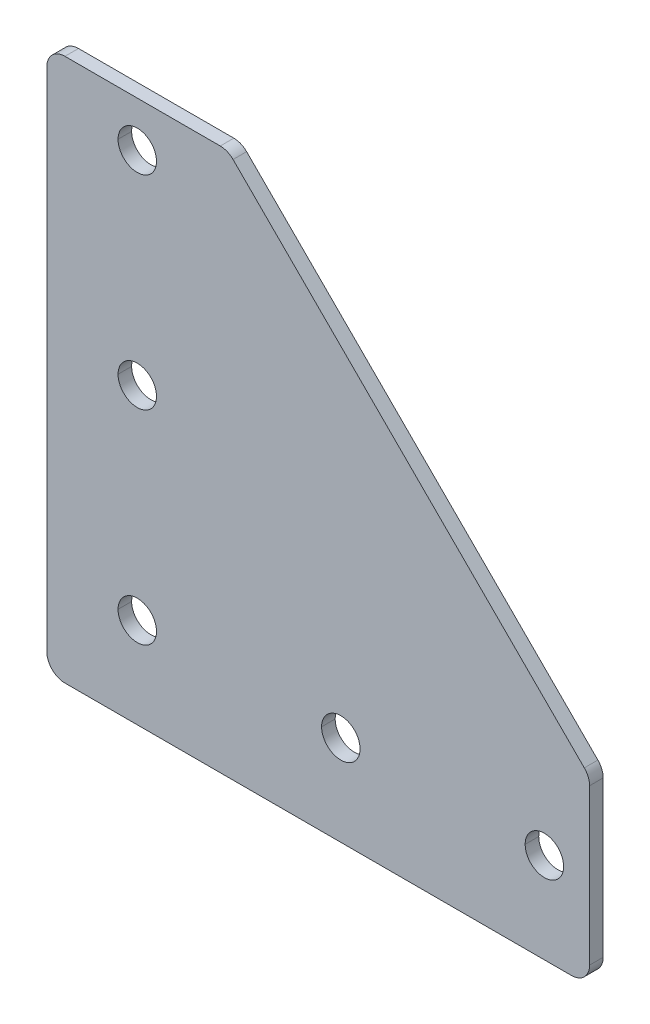
ISO-10303-21;
HEADER;
FILE_DESCRIPTION(('STEP AP214'),'2;1');
FILE_NAME('part.step','',(''),(''),'','','');
FILE_SCHEMA(('AUTOMOTIVE_DESIGN { 1 0 10303 214 1 1 1 1 }'));
ENDSEC;
DATA;
#1=APPLICATION_CONTEXT('core data for automotive mechanical design processes');
#2=APPLICATION_PROTOCOL_DEFINITION('international standard','automotive_design',2000,#1);
#3=PRODUCT_CONTEXT('',#1,'mechanical');
#4=PRODUCT('Part','Part','',(#3));
#5=PRODUCT_RELATED_PRODUCT_CATEGORY('part','',(#4));
#6=PRODUCT_DEFINITION_FORMATION('','',#4);
#7=PRODUCT_DEFINITION_CONTEXT('part definition',#1,'design');
#8=PRODUCT_DEFINITION('design','',#6,#7);
#9=PRODUCT_DEFINITION_SHAPE('','',#8);
#10=(LENGTH_UNIT() NAMED_UNIT(*) SI_UNIT(.MILLI.,.METRE.));
#11=(NAMED_UNIT(*) PLANE_ANGLE_UNIT() SI_UNIT($,.RADIAN.));
#12=(NAMED_UNIT(*) SI_UNIT($,.STERADIAN.) SOLID_ANGLE_UNIT());
#13=UNCERTAINTY_MEASURE_WITH_UNIT(LENGTH_MEASURE(1.E-05),#10,'distance_accuracy_value','');
#14=(GEOMETRIC_REPRESENTATION_CONTEXT(3) GLOBAL_UNCERTAINTY_ASSIGNED_CONTEXT((#13)) GLOBAL_UNIT_ASSIGNED_CONTEXT((#10,
#11,#12)) REPRESENTATION_CONTEXT('',''));
#15=CARTESIAN_POINT('',(0.,0.,0.));
#16=DIRECTION('',(0.,0.,1.));
#17=DIRECTION('',(1.,0.,0.));
#18=AXIS2_PLACEMENT_3D('',#15,#16,#17);
#19=CARTESIAN_POINT('',(0.,0.,0.));
#20=DIRECTION('',(0.,0.,1.));
#21=DIRECTION('',(1.,0.,0.));
#22=AXIS2_PLACEMENT_3D('',#19,#20,#21);
#23=PLANE('',#22);
#24=CARTESIAN_POINT('',(65.,20.,0.));
#25=DIRECTION('',(0.,0.,1.));
#26=DIRECTION('',(1.,0.,0.));
#27=AXIS2_PLACEMENT_3D('',#24,#25,#26);
#28=CIRCLE('',#27,4.25);
#29=CARTESIAN_POINT('',(60.75,20.,0.));
#30=VERTEX_POINT('',#29);
#31=CARTESIAN_POINT('',(69.25,20.,0.));
#32=VERTEX_POINT('',#31);
#33=EDGE_CURVE('E307',#30,#32,#28,.T.);
#34=ORIENTED_EDGE('',*,*,#33,.T.);
#35=CARTESIAN_POINT('',(65.,20.,0.));
#36=DIRECTION('',(0.,0.,1.));
#37=DIRECTION('',(1.,0.,0.));
#38=AXIS2_PLACEMENT_3D('',#35,#36,#37);
#39=CIRCLE('',#38,4.25);
#40=EDGE_CURVE('E319',#32,#30,#39,.T.);
#41=ORIENTED_EDGE('',*,*,#40,.T.);
#42=EDGE_LOOP('',(#34,#41));
#43=FACE_BOUND('',#42,.T.);
#44=CARTESIAN_POINT('',(110.,20.,0.));
#45=DIRECTION('',(0.,0.,1.));
#46=DIRECTION('',(1.,0.,0.));
#47=AXIS2_PLACEMENT_3D('',#44,#45,#46);
#48=CIRCLE('',#47,4.25);
#49=CARTESIAN_POINT('',(105.75,20.,0.));
#50=VERTEX_POINT('',#49);
#51=CARTESIAN_POINT('',(114.25,20.,0.));
#52=VERTEX_POINT('',#51);
#53=EDGE_CURVE('E253',#50,#52,#48,.T.);
#54=ORIENTED_EDGE('',*,*,#53,.T.);
#55=CARTESIAN_POINT('',(110.,20.,0.));
#56=DIRECTION('',(0.,0.,1.));
#57=DIRECTION('',(1.,0.,0.));
#58=AXIS2_PLACEMENT_3D('',#55,#56,#57);
#59=CIRCLE('',#58,4.25);
#60=EDGE_CURVE('E413',#52,#50,#59,.T.);
#61=ORIENTED_EDGE('',*,*,#60,.T.);
#62=EDGE_LOOP('',(#54,#61));
#63=FACE_BOUND('',#62,.T.);
#64=CARTESIAN_POINT('',(20.,20.,0.));
#65=DIRECTION('',(0.,0.,1.));
#66=DIRECTION('',(1.,0.,0.));
#67=AXIS2_PLACEMENT_3D('',#64,#65,#66);
#68=CIRCLE('',#67,4.25);
#69=CARTESIAN_POINT('',(15.75,20.,0.));
#70=VERTEX_POINT('',#69);
#71=CARTESIAN_POINT('',(24.25,20.,0.));
#72=VERTEX_POINT('',#71);
#73=EDGE_CURVE('E256',#70,#72,#68,.T.);
#74=ORIENTED_EDGE('',*,*,#73,.T.);
#75=CARTESIAN_POINT('',(20.,20.,0.));
#76=DIRECTION('',(0.,0.,1.));
#77=DIRECTION('',(1.,0.,0.));
#78=AXIS2_PLACEMENT_3D('',#75,#76,#77);
#79=CIRCLE('',#78,4.25);
#80=EDGE_CURVE('E212',#72,#70,#79,.T.);
#81=ORIENTED_EDGE('',*,*,#80,.T.);
#82=EDGE_LOOP('',(#74,#81));
#83=FACE_BOUND('',#82,.T.);
#84=CARTESIAN_POINT('',(20.,65.,0.));
#85=DIRECTION('',(0.,0.,1.));
#86=DIRECTION('',(1.,0.,0.));
#87=AXIS2_PLACEMENT_3D('',#84,#85,#86);
#88=CIRCLE('',#87,4.25);
#89=CARTESIAN_POINT('',(15.75,65.,0.));
#90=VERTEX_POINT('',#89);
#91=CARTESIAN_POINT('',(24.25,65.,0.));
#92=VERTEX_POINT('',#91);
#93=EDGE_CURVE('E218',#90,#92,#88,.T.);
#94=ORIENTED_EDGE('',*,*,#93,.T.);
#95=CARTESIAN_POINT('',(20.,65.,0.));
#96=DIRECTION('',(0.,0.,1.));
#97=DIRECTION('',(1.,0.,0.));
#98=AXIS2_PLACEMENT_3D('',#95,#96,#97);
#99=CIRCLE('',#98,4.25);
#100=EDGE_CURVE('E211',#92,#90,#99,.T.);
#101=ORIENTED_EDGE('',*,*,#100,.T.);
#102=EDGE_LOOP('',(#94,#101));
#103=FACE_BOUND('',#102,.T.);
#104=CARTESIAN_POINT('',(20.,110.,0.));
#105=DIRECTION('',(0.,0.,1.));
#106=DIRECTION('',(1.,0.,0.));
#107=AXIS2_PLACEMENT_3D('',#104,#105,#106);
#108=CIRCLE('',#107,4.25);
#109=CARTESIAN_POINT('',(15.75,110.,0.));
#110=VERTEX_POINT('',#109);
#111=CARTESIAN_POINT('',(24.25,110.,0.));
#112=VERTEX_POINT('',#111);
#113=EDGE_CURVE('E234',#110,#112,#108,.T.);
#114=ORIENTED_EDGE('',*,*,#113,.T.);
#115=CARTESIAN_POINT('',(20.,110.,0.));
#116=DIRECTION('',(0.,0.,1.));
#117=DIRECTION('',(1.,0.,0.));
#118=AXIS2_PLACEMENT_3D('',#115,#116,#117);
#119=CIRCLE('',#118,4.25);
#120=EDGE_CURVE('E422',#112,#110,#119,.T.);
#121=ORIENTED_EDGE('',*,*,#120,.T.);
#122=EDGE_LOOP('',(#114,#121));
#123=FACE_BOUND('',#122,.T.);
#124=DIRECTION('',(0.707106781186644,-0.707106781186451,0.));
#125=VECTOR('',#124,1.);
#126=CARTESIAN_POINT('',(79.9999999999836,80.0000000000055,0.));
#127=LINE('',#126,#125);
#128=CARTESIAN_POINT('',(41.1715728752392,118.828427124739,0.));
#129=VERTEX_POINT('',#128);
#130=CARTESIAN_POINT('',(118.828427124746,41.1715728752539,0.));
#131=VERTEX_POINT('',#130);
#132=EDGE_CURVE('E315',#129,#131,#127,.T.);
#133=ORIENTED_EDGE('',*,*,#132,.T.);
#134=CARTESIAN_POINT('',(116.,38.3431457505073,0.));
#135=DIRECTION('',(0.,0.,1.));
#136=DIRECTION('',(1.,0.,0.));
#137=AXIS2_PLACEMENT_3D('',#134,#135,#136);
#138=CIRCLE('',#137,4.);
#139=CARTESIAN_POINT('',(120.,38.3431457505073,0.));
#140=VERTEX_POINT('',#139);
#141=EDGE_CURVE('E19',#140,#131,#138,.T.);
#142=ORIENTED_EDGE('',*,*,#141,.F.);
#143=DIRECTION('',(0.,1.,0.));
#144=VECTOR('',#143,1.);
#145=CARTESIAN_POINT('',(120.,0.,0.));
#146=LINE('',#145,#144);
#147=CARTESIAN_POINT('',(120.,4.,0.));
#148=VERTEX_POINT('',#147);
#149=EDGE_CURVE('E399',#148,#140,#146,.T.);
#150=ORIENTED_EDGE('',*,*,#149,.F.);
#151=CARTESIAN_POINT('',(116.,4.,0.));
#152=DIRECTION('',(0.,0.,1.));
#153=DIRECTION('',(1.,0.,0.));
#154=AXIS2_PLACEMENT_3D('',#151,#152,#153);
#155=CIRCLE('',#154,4.);
#156=CARTESIAN_POINT('',(116.,0.,0.));
#157=VERTEX_POINT('',#156);
#158=EDGE_CURVE('E387',#157,#148,#155,.T.);
#159=ORIENTED_EDGE('',*,*,#158,.F.);
#160=DIRECTION('',(1.,0.,0.));
#161=VECTOR('',#160,1.);
#162=CARTESIAN_POINT('',(0.,0.,0.));
#163=LINE('',#162,#161);
#164=CARTESIAN_POINT('',(4.,0.,0.));
#165=VERTEX_POINT('',#164);
#166=EDGE_CURVE('E303',#165,#157,#163,.T.);
#167=ORIENTED_EDGE('',*,*,#166,.F.);
#168=CARTESIAN_POINT('',(4.,4.,0.));
#169=DIRECTION('',(0.,0.,1.));
#170=DIRECTION('',(1.,0.,0.));
#171=AXIS2_PLACEMENT_3D('',#168,#169,#170);
#172=CIRCLE('',#171,4.);
#173=CARTESIAN_POINT('',(0.,4.,0.));
#174=VERTEX_POINT('',#173);
#175=EDGE_CURVE('E373',#174,#165,#172,.T.);
#176=ORIENTED_EDGE('',*,*,#175,.F.);
#177=DIRECTION('',(0.,1.,0.));
#178=VECTOR('',#177,1.);
#179=CARTESIAN_POINT('',(0.,0.,0.));
#180=LINE('',#179,#178);
#181=CARTESIAN_POINT('',(0.,115.999999999993,0.));
#182=VERTEX_POINT('',#181);
#183=EDGE_CURVE('E356',#174,#182,#180,.T.);
#184=ORIENTED_EDGE('',*,*,#183,.T.);
#185=CARTESIAN_POINT('',(4.,115.999999999993,0.));
#186=DIRECTION('',(0.,0.,1.));
#187=DIRECTION('',(1.,0.,0.));
#188=AXIS2_PLACEMENT_3D('',#185,#186,#187);
#189=CIRCLE('',#188,4.);
#190=CARTESIAN_POINT('',(4.,119.999999999993,0.));
#191=VERTEX_POINT('',#190);
#192=EDGE_CURVE('E342',#191,#182,#189,.T.);
#193=ORIENTED_EDGE('',*,*,#192,.F.);
#194=DIRECTION('',(1.,0.,0.));
#195=VECTOR('',#194,1.);
#196=CARTESIAN_POINT('',(0.,119.999999999993,0.));
#197=LINE('',#196,#195);
#198=CARTESIAN_POINT('',(38.3431457504934,119.999999999993,0.));
#199=VERTEX_POINT('',#198);
#200=EDGE_CURVE('E271',#191,#199,#197,.T.);
#201=ORIENTED_EDGE('',*,*,#200,.T.);
#202=CARTESIAN_POINT('',(38.3431457504934,115.999999999993,0.));
#203=DIRECTION('',(0.,0.,1.));
#204=DIRECTION('',(1.,0.,0.));
#205=AXIS2_PLACEMENT_3D('',#202,#203,#204);
#206=CIRCLE('',#205,4.);
#207=EDGE_CURVE('E281',#129,#199,#206,.T.);
#208=ORIENTED_EDGE('',*,*,#207,.F.);
#209=EDGE_LOOP('',(#133,#142,#150,#159,#167,#176,#184,#193,#201,#208));
#210=FACE_BOUND('',#209,.T.);
#211=ADVANCED_FACE('F16',(#43,#63,#83,#103,#123,#210),#23,.F.);
#212=CARTESIAN_POINT('',(0.,0.,3.));
#213=DIRECTION('',(0.,0.,1.));
#214=DIRECTION('',(1.,0.,0.));
#215=AXIS2_PLACEMENT_3D('',#212,#213,#214);
#216=PLANE('',#215);
#217=CARTESIAN_POINT('',(65.,20.,3.));
#218=DIRECTION('',(0.,0.,1.));
#219=DIRECTION('',(1.,0.,0.));
#220=AXIS2_PLACEMENT_3D('',#217,#218,#219);
#221=CIRCLE('',#220,4.25);
#222=CARTESIAN_POINT('',(60.75,20.,3.));
#223=VERTEX_POINT('',#222);
#224=CARTESIAN_POINT('',(69.25,20.,3.));
#225=VERTEX_POINT('',#224);
#226=EDGE_CURVE('E277',#223,#225,#221,.T.);
#227=ORIENTED_EDGE('',*,*,#226,.F.);
#228=CARTESIAN_POINT('',(65.,20.,3.));
#229=DIRECTION('',(0.,0.,1.));
#230=DIRECTION('',(1.,0.,0.));
#231=AXIS2_PLACEMENT_3D('',#228,#229,#230);
#232=CIRCLE('',#231,4.25);
#233=EDGE_CURVE('E316',#225,#223,#232,.T.);
#234=ORIENTED_EDGE('',*,*,#233,.F.);
#235=EDGE_LOOP('',(#227,#234));
#236=FACE_BOUND('',#235,.T.);
#237=CARTESIAN_POINT('',(110.,20.,3.));
#238=DIRECTION('',(0.,0.,1.));
#239=DIRECTION('',(1.,0.,0.));
#240=AXIS2_PLACEMENT_3D('',#237,#238,#239);
#241=CIRCLE('',#240,4.25);
#242=CARTESIAN_POINT('',(105.75,20.,3.));
#243=VERTEX_POINT('',#242);
#244=CARTESIAN_POINT('',(114.25,20.,3.));
#245=VERTEX_POINT('',#244);
#246=EDGE_CURVE('E254',#243,#245,#241,.T.);
#247=ORIENTED_EDGE('',*,*,#246,.F.);
#248=CARTESIAN_POINT('',(110.,20.,3.));
#249=DIRECTION('',(0.,0.,1.));
#250=DIRECTION('',(1.,0.,0.));
#251=AXIS2_PLACEMENT_3D('',#248,#249,#250);
#252=CIRCLE('',#251,4.25);
#253=EDGE_CURVE('E410',#245,#243,#252,.T.);
#254=ORIENTED_EDGE('',*,*,#253,.F.);
#255=EDGE_LOOP('',(#247,#254));
#256=FACE_BOUND('',#255,.T.);
#257=CARTESIAN_POINT('',(20.,20.,3.));
#258=DIRECTION('',(0.,0.,1.));
#259=DIRECTION('',(1.,0.,0.));
#260=AXIS2_PLACEMENT_3D('',#257,#258,#259);
#261=CIRCLE('',#260,4.25);
#262=CARTESIAN_POINT('',(15.75,20.,3.));
#263=VERTEX_POINT('',#262);
#264=CARTESIAN_POINT('',(24.25,20.,3.));
#265=VERTEX_POINT('',#264);
#266=EDGE_CURVE('E220',#263,#265,#261,.T.);
#267=ORIENTED_EDGE('',*,*,#266,.F.);
#268=CARTESIAN_POINT('',(20.,20.,3.));
#269=DIRECTION('',(0.,0.,1.));
#270=DIRECTION('',(1.,0.,0.));
#271=AXIS2_PLACEMENT_3D('',#268,#269,#270);
#272=CIRCLE('',#271,4.25);
#273=EDGE_CURVE('E237',#265,#263,#272,.T.);
#274=ORIENTED_EDGE('',*,*,#273,.F.);
#275=EDGE_LOOP('',(#267,#274));
#276=FACE_BOUND('',#275,.T.);
#277=CARTESIAN_POINT('',(20.,65.,3.));
#278=DIRECTION('',(0.,0.,1.));
#279=DIRECTION('',(1.,0.,0.));
#280=AXIS2_PLACEMENT_3D('',#277,#278,#279);
#281=CIRCLE('',#280,4.25);
#282=CARTESIAN_POINT('',(15.75,65.,3.));
#283=VERTEX_POINT('',#282);
#284=CARTESIAN_POINT('',(24.25,65.,3.));
#285=VERTEX_POINT('',#284);
#286=EDGE_CURVE('E216',#283,#285,#281,.T.);
#287=ORIENTED_EDGE('',*,*,#286,.F.);
#288=CARTESIAN_POINT('',(20.,65.,3.));
#289=DIRECTION('',(0.,0.,1.));
#290=DIRECTION('',(1.,0.,0.));
#291=AXIS2_PLACEMENT_3D('',#288,#289,#290);
#292=CIRCLE('',#291,4.25);
#293=EDGE_CURVE('E200',#285,#283,#292,.T.);
#294=ORIENTED_EDGE('',*,*,#293,.F.);
#295=EDGE_LOOP('',(#287,#294));
#296=FACE_BOUND('',#295,.T.);
#297=CARTESIAN_POINT('',(20.,110.,3.));
#298=DIRECTION('',(0.,0.,1.));
#299=DIRECTION('',(1.,0.,0.));
#300=AXIS2_PLACEMENT_3D('',#297,#298,#299);
#301=CIRCLE('',#300,4.25);
#302=CARTESIAN_POINT('',(15.75,110.,3.));
#303=VERTEX_POINT('',#302);
#304=CARTESIAN_POINT('',(24.25,110.,3.));
#305=VERTEX_POINT('',#304);
#306=EDGE_CURVE('E239',#303,#305,#301,.T.);
#307=ORIENTED_EDGE('',*,*,#306,.F.);
#308=CARTESIAN_POINT('',(20.,110.,3.));
#309=DIRECTION('',(0.,0.,1.));
#310=DIRECTION('',(1.,0.,0.));
#311=AXIS2_PLACEMENT_3D('',#308,#309,#310);
#312=CIRCLE('',#311,4.25);
#313=EDGE_CURVE('E420',#305,#303,#312,.T.);
#314=ORIENTED_EDGE('',*,*,#313,.F.);
#315=EDGE_LOOP('',(#307,#314));
#316=FACE_BOUND('',#315,.T.);
#317=DIRECTION('',(0.707106781186644,-0.707106781186451,0.));
#318=VECTOR('',#317,1.);
#319=CARTESIAN_POINT('',(79.9999999999836,80.0000000000055,3.));
#320=LINE('',#319,#318);
#321=CARTESIAN_POINT('',(41.1715728752392,118.828427124739,3.));
#322=VERTEX_POINT('',#321);
#323=CARTESIAN_POINT('',(118.828427124746,41.1715728752539,3.));
#324=VERTEX_POINT('',#323);
#325=EDGE_CURVE('E327',#322,#324,#320,.T.);
#326=ORIENTED_EDGE('',*,*,#325,.F.);
#327=CARTESIAN_POINT('',(38.3431457504934,115.999999999993,3.));
#328=DIRECTION('',(0.,0.,1.));
#329=DIRECTION('',(1.,0.,0.));
#330=AXIS2_PLACEMENT_3D('',#327,#328,#329);
#331=CIRCLE('',#330,4.);
#332=CARTESIAN_POINT('',(38.3431457504934,119.999999999993,3.));
#333=VERTEX_POINT('',#332);
#334=EDGE_CURVE('E268',#322,#333,#331,.T.);
#335=ORIENTED_EDGE('',*,*,#334,.T.);
#336=DIRECTION('',(1.,0.,0.));
#337=VECTOR('',#336,1.);
#338=CARTESIAN_POINT('',(0.,119.999999999993,3.));
#339=LINE('',#338,#337);
#340=CARTESIAN_POINT('',(4.,119.999999999993,3.));
#341=VERTEX_POINT('',#340);
#342=EDGE_CURVE('E339',#341,#333,#339,.T.);
#343=ORIENTED_EDGE('',*,*,#342,.F.);
#344=CARTESIAN_POINT('',(4.,115.999999999993,3.));
#345=DIRECTION('',(0.,0.,1.));
#346=DIRECTION('',(1.,0.,0.));
#347=AXIS2_PLACEMENT_3D('',#344,#345,#346);
#348=CIRCLE('',#347,4.);
#349=CARTESIAN_POINT('',(0.,115.999999999993,3.));
#350=VERTEX_POINT('',#349);
#351=EDGE_CURVE('E352',#341,#350,#348,.T.);
#352=ORIENTED_EDGE('',*,*,#351,.T.);
#353=DIRECTION('',(0.,1.,0.));
#354=VECTOR('',#353,1.);
#355=CARTESIAN_POINT('',(0.,0.,3.));
#356=LINE('',#355,#354);
#357=CARTESIAN_POINT('',(0.,4.,3.));
#358=VERTEX_POINT('',#357);
#359=EDGE_CURVE('E370',#358,#350,#356,.T.);
#360=ORIENTED_EDGE('',*,*,#359,.F.);
#361=CARTESIAN_POINT('',(4.,4.,3.));
#362=DIRECTION('',(0.,0.,1.));
#363=DIRECTION('',(1.,0.,0.));
#364=AXIS2_PLACEMENT_3D('',#361,#362,#363);
#365=CIRCLE('',#364,4.);
#366=CARTESIAN_POINT('',(4.,0.,3.));
#367=VERTEX_POINT('',#366);
#368=EDGE_CURVE('E331',#358,#367,#365,.T.);
#369=ORIENTED_EDGE('',*,*,#368,.T.);
#370=DIRECTION('',(1.,0.,0.));
#371=VECTOR('',#370,1.);
#372=CARTESIAN_POINT('',(0.,0.,3.));
#373=LINE('',#372,#371);
#374=CARTESIAN_POINT('',(116.,0.,3.));
#375=VERTEX_POINT('',#374);
#376=EDGE_CURVE('E302',#367,#375,#373,.T.);
#377=ORIENTED_EDGE('',*,*,#376,.T.);
#378=CARTESIAN_POINT('',(116.,4.,3.));
#379=DIRECTION('',(0.,0.,1.));
#380=DIRECTION('',(1.,0.,0.));
#381=AXIS2_PLACEMENT_3D('',#378,#379,#380);
#382=CIRCLE('',#381,4.);
#383=CARTESIAN_POINT('',(120.,4.,3.));
#384=VERTEX_POINT('',#383);
#385=EDGE_CURVE('E395',#375,#384,#382,.T.);
#386=ORIENTED_EDGE('',*,*,#385,.T.);
#387=DIRECTION('',(0.,1.,0.));
#388=VECTOR('',#387,1.);
#389=CARTESIAN_POINT('',(120.,0.,3.));
#390=LINE('',#389,#388);
#391=CARTESIAN_POINT('',(120.,38.3431457505073,3.));
#392=VERTEX_POINT('',#391);
#393=EDGE_CURVE('E320',#384,#392,#390,.T.);
#394=ORIENTED_EDGE('',*,*,#393,.T.);
#395=CARTESIAN_POINT('',(116.,38.3431457505073,3.));
#396=DIRECTION('',(0.,0.,1.));
#397=DIRECTION('',(1.,0.,0.));
#398=AXIS2_PLACEMENT_3D('',#395,#396,#397);
#399=CIRCLE('',#398,4.);
#400=EDGE_CURVE('E10',#392,#324,#399,.T.);
#401=ORIENTED_EDGE('',*,*,#400,.T.);
#402=EDGE_LOOP('',(#326,#335,#343,#352,#360,#369,#377,#386,#394,#401));
#403=FACE_BOUND('',#402,.T.);
#404=ADVANCED_FACE('F222',(#236,#256,#276,#296,#316,#403),#216,.T.);
#405=CARTESIAN_POINT('',(116.,38.3431457505073,3.));
#406=DIRECTION('',(0.,0.,-1.));
#407=DIRECTION('',(-1.,0.,0.));
#408=AXIS2_PLACEMENT_3D('',#405,#406,#407);
#409=CYLINDRICAL_SURFACE('',#408,4.);
#410=ORIENTED_EDGE('',*,*,#141,.T.);
#411=DIRECTION('',(0.,0.,-1.));
#412=VECTOR('',#411,1.);
#413=CARTESIAN_POINT('',(118.828427124746,41.1715728752539,3.));
#414=LINE('',#413,#412);
#415=EDGE_CURVE('E335',#324,#131,#414,.T.);
#416=ORIENTED_EDGE('',*,*,#415,.F.);
#417=ORIENTED_EDGE('',*,*,#400,.F.);
#418=DIRECTION('',(0.,0.,-1.));
#419=VECTOR('',#418,1.);
#420=CARTESIAN_POINT('',(120.,38.3431457505073,3.));
#421=LINE('',#420,#419);
#422=EDGE_CURVE('E403',#392,#140,#421,.T.);
#423=ORIENTED_EDGE('',*,*,#422,.T.);
#424=EDGE_LOOP('',(#410,#416,#417,#423));
#425=FACE_BOUND('',#424,.T.);
#426=ADVANCED_FACE('F431',(#425),#409,.T.);
#427=CARTESIAN_POINT('',(20.,110.,3.));
#428=DIRECTION('',(0.,0.,-1.));
#429=DIRECTION('',(-1.,0.,0.));
#430=AXIS2_PLACEMENT_3D('',#427,#428,#429);
#431=CYLINDRICAL_SURFACE('',#430,4.25);
#432=DIRECTION('',(0.,0.,-1.));
#433=VECTOR('',#432,1.);
#434=CARTESIAN_POINT('',(24.25,110.,3.));
#435=LINE('',#434,#433);
#436=EDGE_CURVE('E243',#305,#112,#435,.T.);
#437=ORIENTED_EDGE('',*,*,#436,.F.);
#438=ORIENTED_EDGE('',*,*,#313,.T.);
#439=DIRECTION('',(0.,0.,-1.));
#440=VECTOR('',#439,1.);
#441=CARTESIAN_POINT('',(15.75,110.,3.));
#442=LINE('',#441,#440);
#443=EDGE_CURVE('E225',#303,#110,#442,.T.);
#444=ORIENTED_EDGE('',*,*,#443,.T.);
#445=ORIENTED_EDGE('',*,*,#120,.F.);
#446=EDGE_LOOP('',(#437,#438,#444,#445));
#447=FACE_BOUND('',#446,.T.);
#448=ADVANCED_FACE('F496',(#447),#431,.F.);
#449=CARTESIAN_POINT('',(20.,65.,3.));
#450=DIRECTION('',(0.,0.,-1.));
#451=DIRECTION('',(-1.,0.,0.));
#452=AXIS2_PLACEMENT_3D('',#449,#450,#451);
#453=CYLINDRICAL_SURFACE('',#452,4.25);
#454=DIRECTION('',(0.,0.,-1.));
#455=VECTOR('',#454,1.);
#456=CARTESIAN_POINT('',(24.25,65.,3.));
#457=LINE('',#456,#455);
#458=EDGE_CURVE('E206',#285,#92,#457,.T.);
#459=ORIENTED_EDGE('',*,*,#458,.F.);
#460=ORIENTED_EDGE('',*,*,#293,.T.);
#461=DIRECTION('',(0.,0.,-1.));
#462=VECTOR('',#461,1.);
#463=CARTESIAN_POINT('',(15.75,65.,3.));
#464=LINE('',#463,#462);
#465=EDGE_CURVE('E203',#283,#90,#464,.T.);
#466=ORIENTED_EDGE('',*,*,#465,.T.);
#467=ORIENTED_EDGE('',*,*,#100,.F.);
#468=EDGE_LOOP('',(#459,#460,#466,#467));
#469=FACE_BOUND('',#468,.T.);
#470=ADVANCED_FACE('F202',(#469),#453,.F.);
#471=CARTESIAN_POINT('',(20.,20.,3.));
#472=DIRECTION('',(0.,0.,-1.));
#473=DIRECTION('',(-1.,0.,0.));
#474=AXIS2_PLACEMENT_3D('',#471,#472,#473);
#475=CYLINDRICAL_SURFACE('',#474,4.25);
#476=DIRECTION('',(0.,0.,-1.));
#477=VECTOR('',#476,1.);
#478=CARTESIAN_POINT('',(24.25,20.,3.));
#479=LINE('',#478,#477);
#480=EDGE_CURVE('E261',#265,#72,#479,.T.);
#481=ORIENTED_EDGE('',*,*,#480,.F.);
#482=ORIENTED_EDGE('',*,*,#273,.T.);
#483=DIRECTION('',(0.,0.,-1.));
#484=VECTOR('',#483,1.);
#485=CARTESIAN_POINT('',(15.75,20.,3.));
#486=LINE('',#485,#484);
#487=EDGE_CURVE('E260',#263,#70,#486,.T.);
#488=ORIENTED_EDGE('',*,*,#487,.T.);
#489=ORIENTED_EDGE('',*,*,#80,.F.);
#490=EDGE_LOOP('',(#481,#482,#488,#489));
#491=FACE_BOUND('',#490,.T.);
#492=ADVANCED_FACE('F503',(#491),#475,.F.);
#493=CARTESIAN_POINT('',(110.,20.,3.));
#494=DIRECTION('',(0.,0.,-1.));
#495=DIRECTION('',(-1.,0.,0.));
#496=AXIS2_PLACEMENT_3D('',#493,#494,#495);
#497=CYLINDRICAL_SURFACE('',#496,4.25);
#498=DIRECTION('',(0.,0.,-1.));
#499=VECTOR('',#498,1.);
#500=CARTESIAN_POINT('',(114.25,20.,3.));
#501=LINE('',#500,#499);
#502=EDGE_CURVE('E250',#245,#52,#501,.T.);
#503=ORIENTED_EDGE('',*,*,#502,.F.);
#504=ORIENTED_EDGE('',*,*,#253,.T.);
#505=DIRECTION('',(0.,0.,-1.));
#506=VECTOR('',#505,1.);
#507=CARTESIAN_POINT('',(105.75,20.,3.));
#508=LINE('',#507,#506);
#509=EDGE_CURVE('E267',#243,#50,#508,.T.);
#510=ORIENTED_EDGE('',*,*,#509,.T.);
#511=ORIENTED_EDGE('',*,*,#60,.F.);
#512=EDGE_LOOP('',(#503,#504,#510,#511));
#513=FACE_BOUND('',#512,.T.);
#514=ADVANCED_FACE('F508',(#513),#497,.F.);
#515=CARTESIAN_POINT('',(65.,20.,3.));
#516=DIRECTION('',(0.,0.,-1.));
#517=DIRECTION('',(-1.,0.,0.));
#518=AXIS2_PLACEMENT_3D('',#515,#516,#517);
#519=CYLINDRICAL_SURFACE('',#518,4.25);
#520=DIRECTION('',(0.,0.,-1.));
#521=VECTOR('',#520,1.);
#522=CARTESIAN_POINT('',(69.25,20.,3.));
#523=LINE('',#522,#521);
#524=EDGE_CURVE('E297',#225,#32,#523,.T.);
#525=ORIENTED_EDGE('',*,*,#524,.F.);
#526=ORIENTED_EDGE('',*,*,#233,.T.);
#527=DIRECTION('',(0.,0.,-1.));
#528=VECTOR('',#527,1.);
#529=CARTESIAN_POINT('',(60.75,20.,3.));
#530=LINE('',#529,#528);
#531=EDGE_CURVE('E311',#223,#30,#530,.T.);
#532=ORIENTED_EDGE('',*,*,#531,.T.);
#533=ORIENTED_EDGE('',*,*,#40,.F.);
#534=EDGE_LOOP('',(#525,#526,#532,#533));
#535=FACE_BOUND('',#534,.T.);
#536=ADVANCED_FACE('F515',(#535),#519,.F.);
#537=CARTESIAN_POINT('',(120.,0.,3.));
#538=DIRECTION('',(-1.,0.,0.));
#539=DIRECTION('',(0.,1.,0.));
#540=AXIS2_PLACEMENT_3D('',#537,#538,#539);
#541=PLANE('',#540);
#542=ORIENTED_EDGE('',*,*,#149,.T.);
#543=ORIENTED_EDGE('',*,*,#422,.F.);
#544=ORIENTED_EDGE('',*,*,#393,.F.);
#545=DIRECTION('',(0.,0.,-1.));
#546=VECTOR('',#545,1.);
#547=CARTESIAN_POINT('',(120.,4.,3.));
#548=LINE('',#547,#546);
#549=EDGE_CURVE('E391',#384,#148,#548,.T.);
#550=ORIENTED_EDGE('',*,*,#549,.T.);
#551=EDGE_LOOP('',(#542,#543,#544,#550));
#552=FACE_BOUND('',#551,.T.);
#553=ADVANCED_FACE('F446',(#552),#541,.F.);
#554=CARTESIAN_POINT('',(116.,4.,3.));
#555=DIRECTION('',(0.,0.,-1.));
#556=DIRECTION('',(-1.,0.,0.));
#557=AXIS2_PLACEMENT_3D('',#554,#555,#556);
#558=CYLINDRICAL_SURFACE('',#557,4.);
#559=ORIENTED_EDGE('',*,*,#158,.T.);
#560=ORIENTED_EDGE('',*,*,#549,.F.);
#561=ORIENTED_EDGE('',*,*,#385,.F.);
#562=DIRECTION('',(0.,0.,-1.));
#563=VECTOR('',#562,1.);
#564=CARTESIAN_POINT('',(116.,0.,3.));
#565=LINE('',#564,#563);
#566=EDGE_CURVE('E298',#375,#157,#565,.T.);
#567=ORIENTED_EDGE('',*,*,#566,.T.);
#568=EDGE_LOOP('',(#559,#560,#561,#567));
#569=FACE_BOUND('',#568,.T.);
#570=ADVANCED_FACE('F449',(#569),#558,.T.);
#571=CARTESIAN_POINT('',(0.,0.,3.));
#572=DIRECTION('',(0.,1.,0.));
#573=DIRECTION('',(1.,0.,0.));
#574=AXIS2_PLACEMENT_3D('',#571,#572,#573);
#575=PLANE('',#574);
#576=ORIENTED_EDGE('',*,*,#166,.T.);
#577=ORIENTED_EDGE('',*,*,#566,.F.);
#578=ORIENTED_EDGE('',*,*,#376,.F.);
#579=DIRECTION('',(0.,0.,-1.));
#580=VECTOR('',#579,1.);
#581=CARTESIAN_POINT('',(4.,0.,3.));
#582=LINE('',#581,#580);
#583=EDGE_CURVE('E377',#367,#165,#582,.T.);
#584=ORIENTED_EDGE('',*,*,#583,.T.);
#585=EDGE_LOOP('',(#576,#577,#578,#584));
#586=FACE_BOUND('',#585,.T.);
#587=ADVANCED_FACE('F451',(#586),#575,.F.);
#588=CARTESIAN_POINT('',(4.,4.,3.));
#589=DIRECTION('',(0.,0.,-1.));
#590=DIRECTION('',(-1.,0.,0.));
#591=AXIS2_PLACEMENT_3D('',#588,#589,#590);
#592=CYLINDRICAL_SURFACE('',#591,4.);
#593=ORIENTED_EDGE('',*,*,#175,.T.);
#594=ORIENTED_EDGE('',*,*,#583,.F.);
#595=ORIENTED_EDGE('',*,*,#368,.F.);
#596=DIRECTION('',(0.,0.,-1.));
#597=VECTOR('',#596,1.);
#598=CARTESIAN_POINT('',(0.,4.,3.));
#599=LINE('',#598,#597);
#600=EDGE_CURVE('E366',#358,#174,#599,.T.);
#601=ORIENTED_EDGE('',*,*,#600,.T.);
#602=EDGE_LOOP('',(#593,#594,#595,#601));
#603=FACE_BOUND('',#602,.T.);
#604=ADVANCED_FACE('F454',(#603),#592,.T.);
#605=CARTESIAN_POINT('',(0.,0.,3.));
#606=DIRECTION('',(-1.,0.,0.));
#607=DIRECTION('',(0.,0.,1.));
#608=AXIS2_PLACEMENT_3D('',#605,#606,#607);
#609=PLANE('',#608);
#610=ORIENTED_EDGE('',*,*,#183,.F.);
#611=ORIENTED_EDGE('',*,*,#600,.F.);
#612=ORIENTED_EDGE('',*,*,#359,.T.);
#613=DIRECTION('',(0.,0.,-1.));
#614=VECTOR('',#613,1.);
#615=CARTESIAN_POINT('',(0.,115.999999999993,3.));
#616=LINE('',#615,#614);
#617=EDGE_CURVE('E357',#350,#182,#616,.T.);
#618=ORIENTED_EDGE('',*,*,#617,.T.);
#619=EDGE_LOOP('',(#610,#611,#612,#618));
#620=FACE_BOUND('',#619,.T.);
#621=ADVANCED_FACE('F459',(#620),#609,.T.);
#622=CARTESIAN_POINT('',(4.,115.999999999993,3.));
#623=DIRECTION('',(0.,0.,-1.));
#624=DIRECTION('',(-1.,0.,0.));
#625=AXIS2_PLACEMENT_3D('',#622,#623,#624);
#626=CYLINDRICAL_SURFACE('',#625,4.);
#627=ORIENTED_EDGE('',*,*,#192,.T.);
#628=ORIENTED_EDGE('',*,*,#617,.F.);
#629=ORIENTED_EDGE('',*,*,#351,.F.);
#630=DIRECTION('',(0.,0.,-1.));
#631=VECTOR('',#630,1.);
#632=CARTESIAN_POINT('',(4.,119.999999999993,3.));
#633=LINE('',#632,#631);
#634=EDGE_CURVE('E343',#341,#191,#633,.T.);
#635=ORIENTED_EDGE('',*,*,#634,.T.);
#636=EDGE_LOOP('',(#627,#628,#629,#635));
#637=FACE_BOUND('',#636,.T.);
#638=ADVANCED_FACE('F462',(#637),#626,.T.);
#639=CARTESIAN_POINT('',(0.,119.999999999993,3.));
#640=DIRECTION('',(0.,1.,0.));
#641=DIRECTION('',(1.,0.,0.));
#642=AXIS2_PLACEMENT_3D('',#639,#640,#641);
#643=PLANE('',#642);
#644=ORIENTED_EDGE('',*,*,#200,.F.);
#645=ORIENTED_EDGE('',*,*,#634,.F.);
#646=ORIENTED_EDGE('',*,*,#342,.T.);
#647=DIRECTION('',(0.,0.,-1.));
#648=VECTOR('',#647,1.);
#649=CARTESIAN_POINT('',(38.3431457504934,119.999999999993,3.));
#650=LINE('',#649,#648);
#651=EDGE_CURVE('E272',#333,#199,#650,.T.);
#652=ORIENTED_EDGE('',*,*,#651,.T.);
#653=EDGE_LOOP('',(#644,#645,#646,#652));
#654=FACE_BOUND('',#653,.T.);
#655=ADVANCED_FACE('F465',(#654),#643,.T.);
#656=CARTESIAN_POINT('',(38.3431457504934,115.999999999993,3.));
#657=DIRECTION('',(0.,0.,-1.));
#658=DIRECTION('',(-1.,0.,0.));
#659=AXIS2_PLACEMENT_3D('',#656,#657,#658);
#660=CYLINDRICAL_SURFACE('',#659,4.);
#661=ORIENTED_EDGE('',*,*,#207,.T.);
#662=ORIENTED_EDGE('',*,*,#651,.F.);
#663=ORIENTED_EDGE('',*,*,#334,.F.);
#664=DIRECTION('',(0.,0.,-1.));
#665=VECTOR('',#664,1.);
#666=CARTESIAN_POINT('',(41.1715728752392,118.828427124739,3.));
#667=LINE('',#666,#665);
#668=EDGE_CURVE('E323',#322,#129,#667,.T.);
#669=ORIENTED_EDGE('',*,*,#668,.T.);
#670=EDGE_LOOP('',(#661,#662,#663,#669));
#671=FACE_BOUND('',#670,.T.);
#672=ADVANCED_FACE('F441',(#671),#660,.T.);
#673=CARTESIAN_POINT('',(79.9999999999836,80.0000000000055,3.));
#674=DIRECTION('',(0.707106781186451,0.707106781186644,0.));
#675=DIRECTION('',(0.,0.,-1.));
#676=AXIS2_PLACEMENT_3D('',#673,#674,#675);
#677=PLANE('',#676);
#678=ORIENTED_EDGE('',*,*,#132,.F.);
#679=ORIENTED_EDGE('',*,*,#668,.F.);
#680=ORIENTED_EDGE('',*,*,#325,.T.);
#681=ORIENTED_EDGE('',*,*,#415,.T.);
#682=EDGE_LOOP('',(#678,#679,#680,#681));
#683=FACE_BOUND('',#682,.T.);
#684=ADVANCED_FACE('F435',(#683),#677,.T.);
#685=CARTESIAN_POINT('',(65.,20.,3.));
#686=DIRECTION('',(0.,0.,-1.));
#687=DIRECTION('',(-1.,0.,0.));
#688=AXIS2_PLACEMENT_3D('',#685,#686,#687);
#689=CYLINDRICAL_SURFACE('',#688,4.25);
#690=ORIENTED_EDGE('',*,*,#226,.T.);
#691=ORIENTED_EDGE('',*,*,#524,.T.);
#692=ORIENTED_EDGE('',*,*,#33,.F.);
#693=ORIENTED_EDGE('',*,*,#531,.F.);
#694=EDGE_LOOP('',(#690,#691,#692,#693));
#695=FACE_BOUND('',#694,.T.);
#696=ADVANCED_FACE('F735',(#695),#689,.F.);
#697=CARTESIAN_POINT('',(110.,20.,3.));
#698=DIRECTION('',(0.,0.,-1.));
#699=DIRECTION('',(-1.,0.,0.));
#700=AXIS2_PLACEMENT_3D('',#697,#698,#699);
#701=CYLINDRICAL_SURFACE('',#700,4.25);
#702=ORIENTED_EDGE('',*,*,#246,.T.);
#703=ORIENTED_EDGE('',*,*,#502,.T.);
#704=ORIENTED_EDGE('',*,*,#53,.F.);
#705=ORIENTED_EDGE('',*,*,#509,.F.);
#706=EDGE_LOOP('',(#702,#703,#704,#705));
#707=FACE_BOUND('',#706,.T.);
#708=ADVANCED_FACE('F727',(#707),#701,.F.);
#709=CARTESIAN_POINT('',(20.,20.,3.));
#710=DIRECTION('',(0.,0.,-1.));
#711=DIRECTION('',(-1.,0.,0.));
#712=AXIS2_PLACEMENT_3D('',#709,#710,#711);
#713=CYLINDRICAL_SURFACE('',#712,4.25);
#714=ORIENTED_EDGE('',*,*,#266,.T.);
#715=ORIENTED_EDGE('',*,*,#480,.T.);
#716=ORIENTED_EDGE('',*,*,#73,.F.);
#717=ORIENTED_EDGE('',*,*,#487,.F.);
#718=EDGE_LOOP('',(#714,#715,#716,#717));
#719=FACE_BOUND('',#718,.T.);
#720=ADVANCED_FACE('F521',(#719),#713,.F.);
#721=CARTESIAN_POINT('',(20.,65.,3.));
#722=DIRECTION('',(0.,0.,-1.));
#723=DIRECTION('',(-1.,0.,0.));
#724=AXIS2_PLACEMENT_3D('',#721,#722,#723);
#725=CYLINDRICAL_SURFACE('',#724,4.25);
#726=ORIENTED_EDGE('',*,*,#286,.T.);
#727=ORIENTED_EDGE('',*,*,#458,.T.);
#728=ORIENTED_EDGE('',*,*,#93,.F.);
#729=ORIENTED_EDGE('',*,*,#465,.F.);
#730=EDGE_LOOP('',(#726,#727,#728,#729));
#731=FACE_BOUND('',#730,.T.);
#732=ADVANCED_FACE('F215',(#731),#725,.F.);
#733=CARTESIAN_POINT('',(20.,110.,3.));
#734=DIRECTION('',(0.,0.,-1.));
#735=DIRECTION('',(-1.,0.,0.));
#736=AXIS2_PLACEMENT_3D('',#733,#734,#735);
#737=CYLINDRICAL_SURFACE('',#736,4.25);
#738=ORIENTED_EDGE('',*,*,#306,.T.);
#739=ORIENTED_EDGE('',*,*,#436,.T.);
#740=ORIENTED_EDGE('',*,*,#113,.F.);
#741=ORIENTED_EDGE('',*,*,#443,.F.);
#742=EDGE_LOOP('',(#738,#739,#740,#741));
#743=FACE_BOUND('',#742,.T.);
#744=ADVANCED_FACE('F493',(#743),#737,.F.);
#745=CLOSED_SHELL('',(#211,#404,#426,#448,#470,#492,#514,#536,#553,#570,#587,#604,#621,#638,
#655,#672,#684,#696,#708,#720,#732,#744));
#746=MANIFOLD_SOLID_BREP('B1',#745);
#747=ADVANCED_BREP_SHAPE_REPRESENTATION('',(#18,#746),#14);
#748=SHAPE_DEFINITION_REPRESENTATION(#9,#747);
ENDSEC;
END-ISO-10303-21;
